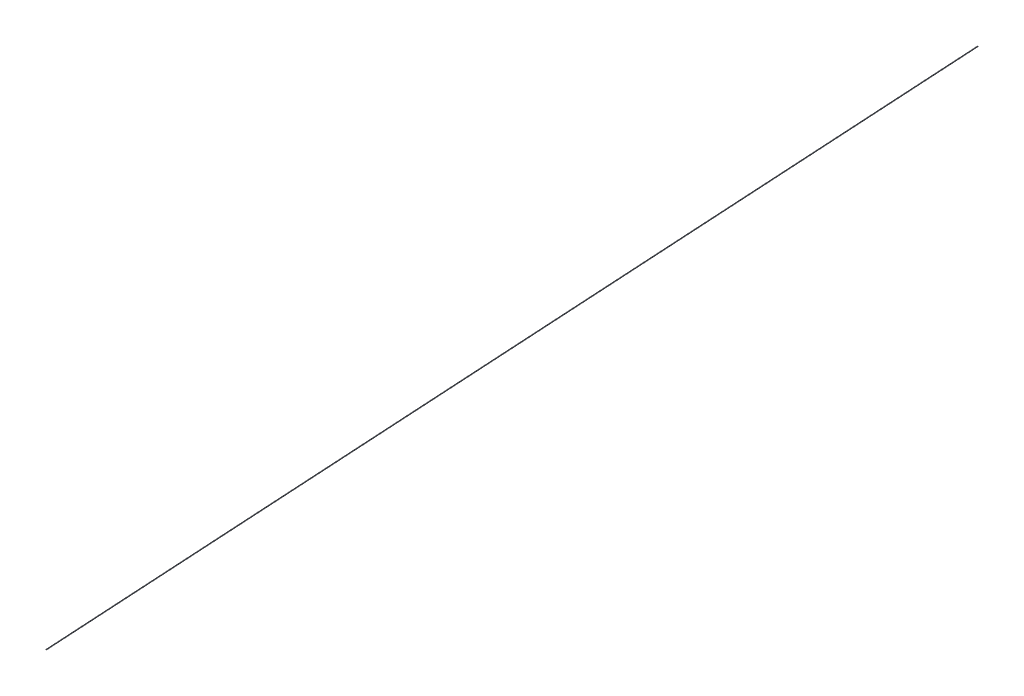
ISO-10303-21;
HEADER;
FILE_DESCRIPTION(('STEP AP214'),'2;1');
FILE_NAME('part.step','',(''),(''),'','','');
FILE_SCHEMA(('AUTOMOTIVE_DESIGN { 1 0 10303 214 1 1 1 1 }'));
ENDSEC;
DATA;
#1=APPLICATION_CONTEXT('core data for automotive mechanical design processes');
#2=APPLICATION_PROTOCOL_DEFINITION('international standard','automotive_design',2000,#1);
#3=PRODUCT_CONTEXT('',#1,'mechanical');
#4=PRODUCT('Part','Part','',(#3));
#5=PRODUCT_RELATED_PRODUCT_CATEGORY('part','',(#4));
#6=PRODUCT_DEFINITION_FORMATION('','',#4);
#7=PRODUCT_DEFINITION_CONTEXT('part definition',#1,'design');
#8=PRODUCT_DEFINITION('design','',#6,#7);
#9=PRODUCT_DEFINITION_SHAPE('','',#8);
#10=(LENGTH_UNIT() NAMED_UNIT(*) SI_UNIT(.MILLI.,.METRE.));
#11=(NAMED_UNIT(*) PLANE_ANGLE_UNIT() SI_UNIT($,.RADIAN.));
#12=(NAMED_UNIT(*) SI_UNIT($,.STERADIAN.) SOLID_ANGLE_UNIT());
#13=UNCERTAINTY_MEASURE_WITH_UNIT(LENGTH_MEASURE(1.E-05),#10,'distance_accuracy_value','');
#14=(GEOMETRIC_REPRESENTATION_CONTEXT(3) GLOBAL_UNCERTAINTY_ASSIGNED_CONTEXT((#13)) GLOBAL_UNIT_ASSIGNED_CONTEXT((#10,
#11,#12)) REPRESENTATION_CONTEXT('',''));
#15=CARTESIAN_POINT('',(0.,0.,0.));
#16=DIRECTION('',(0.,0.,1.));
#17=DIRECTION('',(1.,0.,0.));
#18=AXIS2_PLACEMENT_3D('',#15,#16,#17);
#19=CARTESIAN_POINT('',(0.,0.,0.));
#20=DIRECTION('',(0.,0.,1.));
#21=DIRECTION('',(1.,0.,0.));
#22=AXIS2_PLACEMENT_3D('',#19,#20,#21);
#23=PLANE('',#22);
#24=CARTESIAN_POINT('',(0.,0.,0.));
#25=DIRECTION('',(0.,0.,1.));
#26=DIRECTION('',(1.,0.,0.));
#27=AXIS2_PLACEMENT_3D('',#24,#25,#26);
#28=CIRCLE('',#27,3.8);
#29=CARTESIAN_POINT('',(3.8,0.,0.));
#30=VERTEX_POINT('',#29);
#31=EDGE_CURVE('E40',#30,#30,#28,.T.);
#32=ORIENTED_EDGE('',*,*,#31,.T.);
#33=EDGE_LOOP('',(#32));
#34=FACE_BOUND('',#33,.T.);
#35=ADVANCED_FACE('F37',(#34),#23,.T.);
#36=CARTESIAN_POINT('',(0.,857.6,-14101.6));
#37=DIRECTION('',(0.,0.,1.));
#38=DIRECTION('',(1.,0.,0.));
#39=AXIS2_PLACEMENT_3D('',#36,#37,#38);
#40=PLANE('',#39);
#41=CARTESIAN_POINT('',(0.,857.6,-14101.6));
#42=DIRECTION('',(0.,0.,1.));
#43=DIRECTION('',(1.,0.,0.));
#44=AXIS2_PLACEMENT_3D('',#41,#42,#43);
#45=CIRCLE('',#44,3.8);
#46=CARTESIAN_POINT('',(3.8,857.6,-14101.6));
#47=VERTEX_POINT('',#46);
#48=EDGE_CURVE('E45',#47,#47,#45,.T.);
#49=ORIENTED_EDGE('',*,*,#48,.F.);
#50=EDGE_LOOP('',(#49));
#51=FACE_BOUND('',#50,.T.);
#52=ADVANCED_FACE('F65',(#51),#40,.F.);
#53=CARTESIAN_POINT('',(0.,0.,-10.3543354524741));
#54=DIRECTION('',(0.,0.,1.));
#55=DIRECTION('',(1.,0.,0.));
#56=AXIS2_PLACEMENT_3D('',#53,#54,#55);
#57=CYLINDRICAL_SURFACE('',#56,3.8);
#58=CARTESIAN_POINT('',(0.,1.11022302462516E-13,-10.0000000000016));
#59=DIRECTION('',(0.,-0.0304088317770458,0.999537544542453));
#60=DIRECTION('',(0.,-0.999537544542453,-0.0304088317770458));
#61=AXIS2_PLACEMENT_3D('',#58,#59,#60);
#62=ELLIPSE('',#61,3.80175814380188,3.8);
#63=CARTESIAN_POINT('',(0.,-3.79999999999989,-10.1156070238534));
#64=VERTEX_POINT('',#63);
#65=EDGE_CURVE('E51',#64,#64,#62,.F.);
#66=ORIENTED_EDGE('',*,*,#65,.F.);
#67=EDGE_LOOP('',(#66));
#68=FACE_BOUND('',#67,.T.);
#69=ORIENTED_EDGE('',*,*,#31,.F.);
#70=EDGE_LOOP('',(#69));
#71=FACE_BOUND('',#70,.T.);
#72=ADVANCED_FACE('F62',(#68,#71),#57,.T.);
#73=CARTESIAN_POINT('',(0.,857.621539888486,-14091.9536801466));
#74=DIRECTION('',(0.,-0.0607895380936657,0.998150605899911));
#75=DIRECTION('',(0.,-0.998150605899911,-0.0607895380936657));
#76=AXIS2_PLACEMENT_3D('',#73,#74,#75);
#77=CYLINDRICAL_SURFACE('',#76,3.8);
#78=CARTESIAN_POINT('',(0.,857.6,-14091.6));
#79=DIRECTION('',(0.,-0.0304088317770513,0.999537544542452));
#80=DIRECTION('',(0.,0.999537544542452,0.0304088317770513));
#81=AXIS2_PLACEMENT_3D('',#78,#79,#80);
#82=ELLIPSE('',#81,3.80175814380188,3.8);
#83=CARTESIAN_POINT('',(0.,861.4,-14091.4843929761));
#84=VERTEX_POINT('',#83);
#85=EDGE_CURVE('E10',#84,#84,#82,.F.);
#86=ORIENTED_EDGE('',*,*,#85,.F.);
#87=EDGE_LOOP('',(#86));
#88=FACE_BOUND('',#87,.T.);
#89=ORIENTED_EDGE('',*,*,#65,.T.);
#90=EDGE_LOOP('',(#89));
#91=FACE_BOUND('',#90,.T.);
#92=ADVANCED_FACE('F64',(#88,#91),#77,.T.);
#93=CARTESIAN_POINT('',(0.,857.6,-14101.6));
#94=DIRECTION('',(0.,0.,1.));
#95=DIRECTION('',(0.,-1.,0.));
#96=AXIS2_PLACEMENT_3D('',#93,#94,#95);
#97=CYLINDRICAL_SURFACE('',#96,3.8);
#98=ORIENTED_EDGE('',*,*,#48,.T.);
#99=EDGE_LOOP('',(#98));
#100=FACE_BOUND('',#99,.T.);
#101=ORIENTED_EDGE('',*,*,#85,.T.);
#102=EDGE_LOOP('',(#101));
#103=FACE_BOUND('',#102,.T.);
#104=ADVANCED_FACE('F72',(#100,#103),#97,.T.);
#105=CLOSED_SHELL('',(#35,#52,#72,#92,#104));
#106=MANIFOLD_SOLID_BREP('B2',#105);
#107=ADVANCED_BREP_SHAPE_REPRESENTATION('',(#18,#106),#14);
#108=SHAPE_DEFINITION_REPRESENTATION(#9,#107);
ENDSEC;
END-ISO-10303-21;
